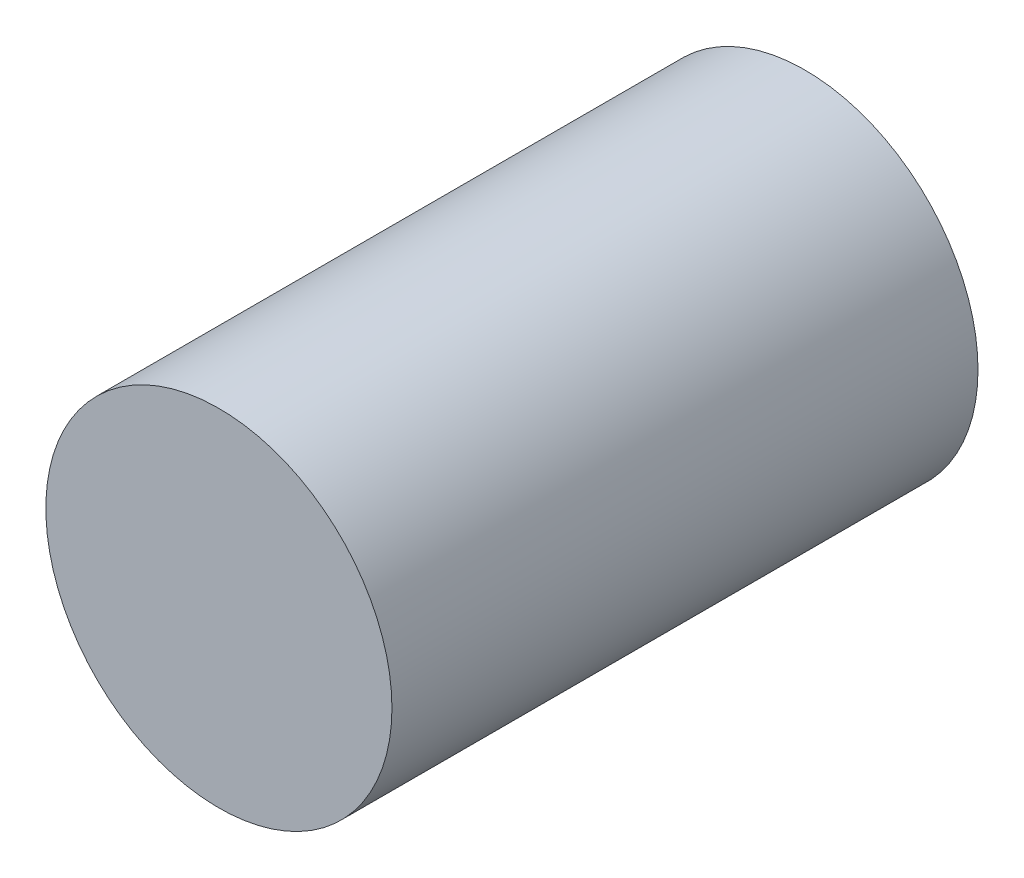
ISO-10303-21;
HEADER;
FILE_DESCRIPTION(('STEP AP214'),'2;1');
FILE_NAME('part.step','',(''),(''),'','','');
FILE_SCHEMA(('AUTOMOTIVE_DESIGN { 1 0 10303 214 1 1 1 1 }'));
ENDSEC;
DATA;
#1=APPLICATION_CONTEXT('core data for automotive mechanical design processes');
#2=APPLICATION_PROTOCOL_DEFINITION('international standard','automotive_design',2000,#1);
#3=PRODUCT_CONTEXT('',#1,'mechanical');
#4=PRODUCT('Part','Part','',(#3));
#5=PRODUCT_RELATED_PRODUCT_CATEGORY('part','',(#4));
#6=PRODUCT_DEFINITION_FORMATION('','',#4);
#7=PRODUCT_DEFINITION_CONTEXT('part definition',#1,'design');
#8=PRODUCT_DEFINITION('design','',#6,#7);
#9=PRODUCT_DEFINITION_SHAPE('','',#8);
#10=(LENGTH_UNIT() NAMED_UNIT(*) SI_UNIT(.MILLI.,.METRE.));
#11=(NAMED_UNIT(*) PLANE_ANGLE_UNIT() SI_UNIT($,.RADIAN.));
#12=(NAMED_UNIT(*) SI_UNIT($,.STERADIAN.) SOLID_ANGLE_UNIT());
#13=UNCERTAINTY_MEASURE_WITH_UNIT(LENGTH_MEASURE(1.E-05),#10,'distance_accuracy_value','');
#14=(GEOMETRIC_REPRESENTATION_CONTEXT(3) GLOBAL_UNCERTAINTY_ASSIGNED_CONTEXT((#13)) GLOBAL_UNIT_ASSIGNED_CONTEXT((#10,
#11,#12)) REPRESENTATION_CONTEXT('',''));
#15=CARTESIAN_POINT('',(0.,0.,0.));
#16=DIRECTION('',(0.,0.,1.));
#17=DIRECTION('',(1.,0.,0.));
#18=AXIS2_PLACEMENT_3D('',#15,#16,#17);
#19=CARTESIAN_POINT('',(0.,0.,25.4));
#20=DIRECTION('',(0.,0.,-1.));
#21=DIRECTION('',(-1.,0.,0.));
#22=AXIS2_PLACEMENT_3D('',#19,#20,#21);
#23=CYLINDRICAL_SURFACE('',#22,7.5);
#24=CARTESIAN_POINT('',(0.,0.,25.4));
#25=DIRECTION('',(0.,0.,1.));
#26=DIRECTION('',(1.,0.,0.));
#27=AXIS2_PLACEMENT_3D('',#24,#25,#26);
#28=CIRCLE('',#27,7.5);
#29=CARTESIAN_POINT('',(7.5,0.,25.4));
#30=VERTEX_POINT('',#29);
#31=EDGE_CURVE('E10',#30,#30,#28,.T.);
#32=ORIENTED_EDGE('',*,*,#31,.F.);
#33=EDGE_LOOP('',(#32));
#34=FACE_BOUND('',#33,.T.);
#35=CARTESIAN_POINT('',(0.,0.,0.));
#36=DIRECTION('',(0.,0.,1.));
#37=DIRECTION('',(1.,0.,0.));
#38=AXIS2_PLACEMENT_3D('',#35,#36,#37);
#39=CIRCLE('',#38,7.5);
#40=CARTESIAN_POINT('',(7.5,0.,0.));
#41=VERTEX_POINT('',#40);
#42=EDGE_CURVE('E34',#41,#41,#39,.T.);
#43=ORIENTED_EDGE('',*,*,#42,.T.);
#44=EDGE_LOOP('',(#43));
#45=FACE_BOUND('',#44,.T.);
#46=ADVANCED_FACE('F31',(#34,#45),#23,.T.);
#47=CARTESIAN_POINT('',(0.,0.,25.4));
#48=DIRECTION('',(0.,0.,1.));
#49=DIRECTION('',(1.,0.,0.));
#50=AXIS2_PLACEMENT_3D('',#47,#48,#49);
#51=PLANE('',#50);
#52=ORIENTED_EDGE('',*,*,#31,.T.);
#53=EDGE_LOOP('',(#52));
#54=FACE_BOUND('',#53,.T.);
#55=ADVANCED_FACE('F46',(#54),#51,.T.);
#56=CARTESIAN_POINT('',(0.,0.,0.));
#57=DIRECTION('',(0.,0.,1.));
#58=DIRECTION('',(1.,0.,0.));
#59=AXIS2_PLACEMENT_3D('',#56,#57,#58);
#60=PLANE('',#59);
#61=ORIENTED_EDGE('',*,*,#42,.F.);
#62=EDGE_LOOP('',(#61));
#63=FACE_BOUND('',#62,.T.);
#64=ADVANCED_FACE('F44',(#63),#60,.F.);
#65=CLOSED_SHELL('',(#46,#55,#64));
#66=MANIFOLD_SOLID_BREP('B2',#65);
#67=ADVANCED_BREP_SHAPE_REPRESENTATION('',(#18,#66),#14);
#68=SHAPE_DEFINITION_REPRESENTATION(#9,#67);
ENDSEC;
END-ISO-10303-21;
